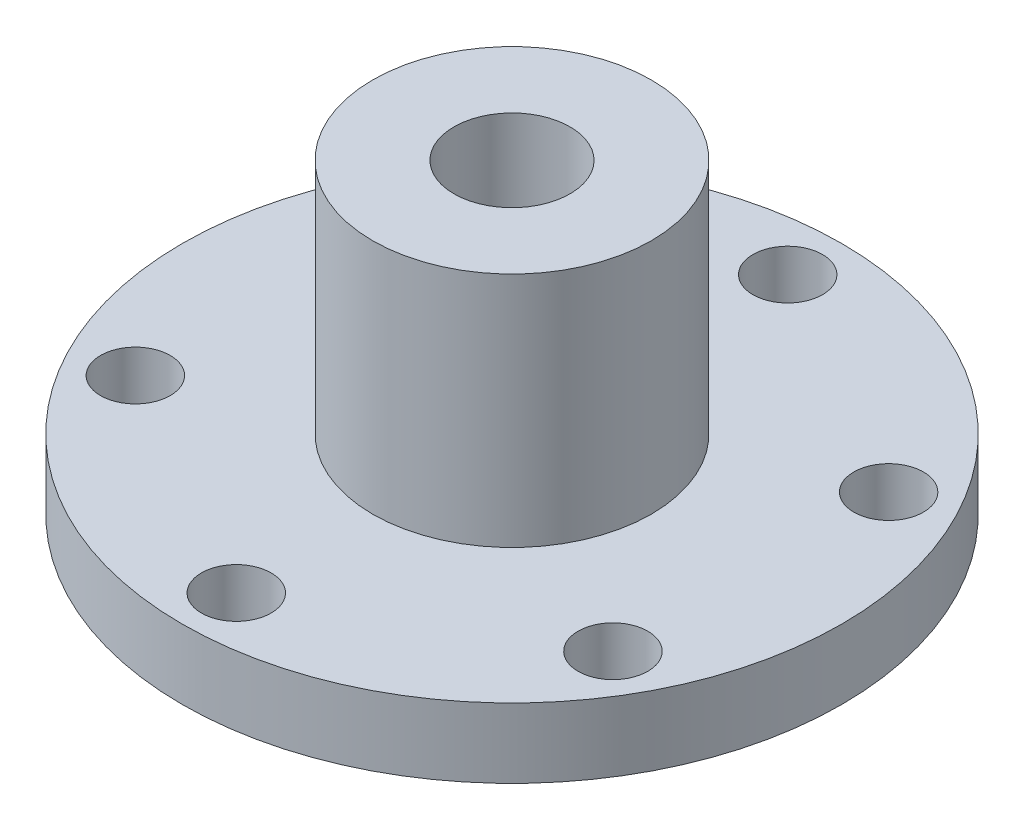
ISO-10303-21;
HEADER;
FILE_DESCRIPTION(('STEP AP214'),'2;1');
FILE_NAME('part.step','',(''),(''),'','','');
FILE_SCHEMA(('AUTOMOTIVE_DESIGN { 1 0 10303 214 1 1 1 1 }'));
ENDSEC;
DATA;
#1=APPLICATION_CONTEXT('core data for automotive mechanical design processes');
#2=APPLICATION_PROTOCOL_DEFINITION('international standard','automotive_design',2000,#1);
#3=PRODUCT_CONTEXT('',#1,'mechanical');
#4=PRODUCT('Part','Part','',(#3));
#5=PRODUCT_RELATED_PRODUCT_CATEGORY('part','',(#4));
#6=PRODUCT_DEFINITION_FORMATION('','',#4);
#7=PRODUCT_DEFINITION_CONTEXT('part definition',#1,'design');
#8=PRODUCT_DEFINITION('design','',#6,#7);
#9=PRODUCT_DEFINITION_SHAPE('','',#8);
#10=(LENGTH_UNIT() NAMED_UNIT(*) SI_UNIT(.MILLI.,.METRE.));
#11=(NAMED_UNIT(*) PLANE_ANGLE_UNIT() SI_UNIT($,.RADIAN.));
#12=(NAMED_UNIT(*) SI_UNIT($,.STERADIAN.) SOLID_ANGLE_UNIT());
#13=UNCERTAINTY_MEASURE_WITH_UNIT(LENGTH_MEASURE(1.E-05),#10,'distance_accuracy_value','');
#14=(GEOMETRIC_REPRESENTATION_CONTEXT(3) GLOBAL_UNCERTAINTY_ASSIGNED_CONTEXT((#13)) GLOBAL_UNIT_ASSIGNED_CONTEXT((#10,
#11,#12)) REPRESENTATION_CONTEXT('',''));
#15=CARTESIAN_POINT('',(0.,0.,0.));
#16=DIRECTION('',(0.,0.,1.));
#17=DIRECTION('',(1.,0.,0.));
#18=AXIS2_PLACEMENT_3D('',#15,#16,#17);
#19=CARTESIAN_POINT('',(0.,6.,0.));
#20=DIRECTION('',(0.,1.,0.));
#21=DIRECTION('',(0.,0.,1.));
#22=AXIS2_PLACEMENT_3D('',#19,#20,#21);
#23=PLANE('',#22);
#24=CARTESIAN_POINT('',(-20.5681033398798,6.,-11.8749999999988));
#25=DIRECTION('',(0.,1.,0.));
#26=DIRECTION('',(0.,0.,1.));
#27=AXIS2_PLACEMENT_3D('',#24,#25,#26);
#28=CIRCLE('',#27,3.00000000000126);
#29=CARTESIAN_POINT('',(-20.5681033398798,6.,-8.87499999999756));
#30=VERTEX_POINT('',#29);
#31=EDGE_CURVE('E78',#30,#30,#28,.T.);
#32=ORIENTED_EDGE('',*,*,#31,.F.);
#33=EDGE_LOOP('',(#32));
#34=FACE_BOUND('',#33,.T.);
#35=CARTESIAN_POINT('',(2.69133678744446E-12,6.,23.75));
#36=DIRECTION('',(0.,1.,0.));
#37=DIRECTION('',(0.,0.,1.));
#38=AXIS2_PLACEMENT_3D('',#35,#36,#37);
#39=CIRCLE('',#38,3.00000000000273);
#40=CARTESIAN_POINT('',(2.69133678744446E-12,6.,26.7500000000027));
#41=VERTEX_POINT('',#40);
#42=EDGE_CURVE('E66',#41,#41,#39,.T.);
#43=ORIENTED_EDGE('',*,*,#42,.F.);
#44=EDGE_LOOP('',(#43));
#45=FACE_BOUND('',#44,.T.);
#46=CARTESIAN_POINT('',(20.5681033398811,6.,-11.8750000000012));
#47=DIRECTION('',(0.,1.,0.));
#48=DIRECTION('',(0.,0.,1.));
#49=AXIS2_PLACEMENT_3D('',#46,#47,#48);
#50=CIRCLE('',#49,3.00000000000036);
#51=CARTESIAN_POINT('',(20.5681033398811,6.,-8.87500000000081));
#52=VERTEX_POINT('',#51);
#53=EDGE_CURVE('E54',#52,#52,#50,.T.);
#54=ORIENTED_EDGE('',*,*,#53,.F.);
#55=EDGE_LOOP('',(#54));
#56=FACE_BOUND('',#55,.T.);
#57=CARTESIAN_POINT('',(0.,6.,0.));
#58=DIRECTION('',(0.,1.,0.));
#59=DIRECTION('',(0.,0.,1.));
#60=AXIS2_PLACEMENT_3D('',#57,#58,#59);
#61=CIRCLE('',#60,28.4);
#62=CARTESIAN_POINT('',(0.,6.,28.4));
#63=VERTEX_POINT('',#62);
#64=EDGE_CURVE('E10',#63,#63,#61,.T.);
#65=ORIENTED_EDGE('',*,*,#64,.T.);
#66=EDGE_LOOP('',(#65));
#67=FACE_BOUND('',#66,.T.);
#68=CARTESIAN_POINT('',(0.,6.,-23.75));
#69=DIRECTION('',(0.,1.,0.));
#70=DIRECTION('',(0.,0.,1.));
#71=AXIS2_PLACEMENT_3D('',#68,#69,#70);
#72=CIRCLE('',#71,3.);
#73=CARTESIAN_POINT('',(0.,6.,-20.75));
#74=VERTEX_POINT('',#73);
#75=EDGE_CURVE('E50',#74,#74,#72,.T.);
#76=ORIENTED_EDGE('',*,*,#75,.F.);
#77=EDGE_LOOP('',(#76));
#78=FACE_BOUND('',#77,.T.);
#79=CARTESIAN_POINT('',(20.5681033398824,6.,11.8749999999988));
#80=DIRECTION('',(0.,1.,0.));
#81=DIRECTION('',(0.,0.,1.));
#82=AXIS2_PLACEMENT_3D('',#79,#80,#81);
#83=CIRCLE('',#82,3.0000000000017);
#84=CARTESIAN_POINT('',(20.5681033398824,6.,14.8750000000005));
#85=VERTEX_POINT('',#84);
#86=EDGE_CURVE('E60',#85,#85,#83,.T.);
#87=ORIENTED_EDGE('',*,*,#86,.F.);
#88=EDGE_LOOP('',(#87));
#89=FACE_BOUND('',#88,.T.);
#90=CARTESIAN_POINT('',(-20.5681033398784,6.,11.8750000000012));
#91=DIRECTION('',(0.,1.,0.));
#92=DIRECTION('',(0.,0.,1.));
#93=AXIS2_PLACEMENT_3D('',#90,#91,#92);
#94=CIRCLE('',#93,3.00000000000249);
#95=CARTESIAN_POINT('',(-20.5681033398784,6.,14.8750000000037));
#96=VERTEX_POINT('',#95);
#97=EDGE_CURVE('E72',#96,#96,#94,.T.);
#98=ORIENTED_EDGE('',*,*,#97,.F.);
#99=EDGE_LOOP('',(#98));
#100=FACE_BOUND('',#99,.T.);
#101=CARTESIAN_POINT('',(0.,6.,0.));
#102=DIRECTION('',(0.,1.,0.));
#103=DIRECTION('',(0.,0.,1.));
#104=AXIS2_PLACEMENT_3D('',#101,#102,#103);
#105=CIRCLE('',#104,12.);
#106=CARTESIAN_POINT('',(0.,6.,12.));
#107=VERTEX_POINT('',#106);
#108=EDGE_CURVE('E87',#107,#107,#105,.T.);
#109=ORIENTED_EDGE('',*,*,#108,.F.);
#110=EDGE_LOOP('',(#109));
#111=FACE_BOUND('',#110,.T.);
#112=ADVANCED_FACE('F35',(#34,#45,#56,#67,#78,#89,#100,#111),#23,.T.);
#113=CARTESIAN_POINT('',(0.,0.,0.));
#114=DIRECTION('',(0.,1.,0.));
#115=DIRECTION('',(0.,0.,1.));
#116=AXIS2_PLACEMENT_3D('',#113,#114,#115);
#117=PLANE('',#116);
#118=CARTESIAN_POINT('',(0.,0.,0.));
#119=DIRECTION('',(0.,1.,0.));
#120=DIRECTION('',(0.,0.,1.));
#121=AXIS2_PLACEMENT_3D('',#118,#119,#120);
#122=CIRCLE('',#121,28.4);
#123=CARTESIAN_POINT('',(0.,0.,28.4));
#124=VERTEX_POINT('',#123);
#125=EDGE_CURVE('E39',#124,#124,#122,.T.);
#126=ORIENTED_EDGE('',*,*,#125,.F.);
#127=EDGE_LOOP('',(#126));
#128=FACE_BOUND('',#127,.T.);
#129=CARTESIAN_POINT('',(0.,0.,0.));
#130=DIRECTION('',(0.,1.,0.));
#131=DIRECTION('',(0.,0.,1.));
#132=AXIS2_PLACEMENT_3D('',#129,#130,#131);
#133=CIRCLE('',#132,5.);
#134=CARTESIAN_POINT('',(0.,0.,5.));
#135=VERTEX_POINT('',#134);
#136=EDGE_CURVE('E46',#135,#135,#133,.T.);
#137=ORIENTED_EDGE('',*,*,#136,.T.);
#138=EDGE_LOOP('',(#137));
#139=FACE_BOUND('',#138,.T.);
#140=CARTESIAN_POINT('',(0.,0.,-23.75));
#141=DIRECTION('',(0.,1.,0.));
#142=DIRECTION('',(0.,0.,1.));
#143=AXIS2_PLACEMENT_3D('',#140,#141,#142);
#144=CIRCLE('',#143,3.);
#145=CARTESIAN_POINT('',(0.,0.,-20.75));
#146=VERTEX_POINT('',#145);
#147=EDGE_CURVE('E51',#146,#146,#144,.T.);
#148=ORIENTED_EDGE('',*,*,#147,.T.);
#149=EDGE_LOOP('',(#148));
#150=FACE_BOUND('',#149,.T.);
#151=CARTESIAN_POINT('',(20.5681033398811,0.,-11.8750000000012));
#152=DIRECTION('',(0.,1.,0.));
#153=DIRECTION('',(0.,0.,1.));
#154=AXIS2_PLACEMENT_3D('',#151,#152,#153);
#155=CIRCLE('',#154,3.00000000000036);
#156=CARTESIAN_POINT('',(20.5681033398811,0.,-8.87500000000081));
#157=VERTEX_POINT('',#156);
#158=EDGE_CURVE('E57',#157,#157,#155,.T.);
#159=ORIENTED_EDGE('',*,*,#158,.T.);
#160=EDGE_LOOP('',(#159));
#161=FACE_BOUND('',#160,.T.);
#162=CARTESIAN_POINT('',(20.5681033398824,0.,11.8749999999988));
#163=DIRECTION('',(0.,1.,0.));
#164=DIRECTION('',(0.,0.,1.));
#165=AXIS2_PLACEMENT_3D('',#162,#163,#164);
#166=CIRCLE('',#165,3.0000000000017);
#167=CARTESIAN_POINT('',(20.5681033398824,0.,14.8750000000005));
#168=VERTEX_POINT('',#167);
#169=EDGE_CURVE('E63',#168,#168,#166,.T.);
#170=ORIENTED_EDGE('',*,*,#169,.T.);
#171=EDGE_LOOP('',(#170));
#172=FACE_BOUND('',#171,.T.);
#173=CARTESIAN_POINT('',(2.69133678744446E-12,0.,23.75));
#174=DIRECTION('',(0.,1.,0.));
#175=DIRECTION('',(0.,0.,1.));
#176=AXIS2_PLACEMENT_3D('',#173,#174,#175);
#177=CIRCLE('',#176,3.00000000000273);
#178=CARTESIAN_POINT('',(2.69133678744446E-12,0.,26.7500000000027));
#179=VERTEX_POINT('',#178);
#180=EDGE_CURVE('E69',#179,#179,#177,.T.);
#181=ORIENTED_EDGE('',*,*,#180,.T.);
#182=EDGE_LOOP('',(#181));
#183=FACE_BOUND('',#182,.T.);
#184=CARTESIAN_POINT('',(-20.5681033398784,0.,11.8750000000012));
#185=DIRECTION('',(0.,1.,0.));
#186=DIRECTION('',(0.,0.,1.));
#187=AXIS2_PLACEMENT_3D('',#184,#185,#186);
#188=CIRCLE('',#187,3.00000000000249);
#189=CARTESIAN_POINT('',(-20.5681033398784,0.,14.8750000000037));
#190=VERTEX_POINT('',#189);
#191=EDGE_CURVE('E75',#190,#190,#188,.T.);
#192=ORIENTED_EDGE('',*,*,#191,.T.);
#193=EDGE_LOOP('',(#192));
#194=FACE_BOUND('',#193,.T.);
#195=CARTESIAN_POINT('',(-20.5681033398798,0.,-11.8749999999988));
#196=DIRECTION('',(0.,1.,0.));
#197=DIRECTION('',(0.,0.,1.));
#198=AXIS2_PLACEMENT_3D('',#195,#196,#197);
#199=CIRCLE('',#198,3.00000000000126);
#200=CARTESIAN_POINT('',(-20.5681033398798,0.,-8.87499999999756));
#201=VERTEX_POINT('',#200);
#202=EDGE_CURVE('E81',#201,#201,#199,.T.);
#203=ORIENTED_EDGE('',*,*,#202,.T.);
#204=EDGE_LOOP('',(#203));
#205=FACE_BOUND('',#204,.T.);
#206=ADVANCED_FACE('F114',(#128,#139,#150,#161,#172,#183,#194,#205),#117,.F.);
#207=CARTESIAN_POINT('',(0.,6.,0.));
#208=DIRECTION('',(0.,-1.,0.));
#209=DIRECTION('',(0.,0.,-1.));
#210=AXIS2_PLACEMENT_3D('',#207,#208,#209);
#211=CYLINDRICAL_SURFACE('',#210,28.4);
#212=ORIENTED_EDGE('',*,*,#64,.F.);
#213=EDGE_LOOP('',(#212));
#214=FACE_BOUND('',#213,.T.);
#215=ORIENTED_EDGE('',*,*,#125,.T.);
#216=EDGE_LOOP('',(#215));
#217=FACE_BOUND('',#216,.T.);
#218=ADVANCED_FACE('F37',(#214,#217),#211,.T.);
#219=CARTESIAN_POINT('',(0.,6.,0.));
#220=DIRECTION('',(0.,-1.,0.));
#221=DIRECTION('',(0.,0.,-1.));
#222=AXIS2_PLACEMENT_3D('',#219,#220,#221);
#223=CYLINDRICAL_SURFACE('',#222,5.);
#224=ORIENTED_EDGE('',*,*,#136,.F.);
#225=EDGE_LOOP('',(#224));
#226=FACE_BOUND('',#225,.T.);
#227=CARTESIAN_POINT('',(0.,26.4,0.));
#228=DIRECTION('',(0.,1.,0.));
#229=DIRECTION('',(0.,0.,1.));
#230=AXIS2_PLACEMENT_3D('',#227,#228,#229);
#231=CIRCLE('',#230,5.);
#232=CARTESIAN_POINT('',(0.,26.4,5.));
#233=VERTEX_POINT('',#232);
#234=EDGE_CURVE('E90',#233,#233,#231,.T.);
#235=ORIENTED_EDGE('',*,*,#234,.T.);
#236=EDGE_LOOP('',(#235));
#237=FACE_BOUND('',#236,.T.);
#238=ADVANCED_FACE('F96',(#226,#237),#223,.F.);
#239=CARTESIAN_POINT('',(0.,6.,-23.75));
#240=DIRECTION('',(0.,-1.,0.));
#241=DIRECTION('',(0.,0.,-1.));
#242=AXIS2_PLACEMENT_3D('',#239,#240,#241);
#243=CYLINDRICAL_SURFACE('',#242,3.);
#244=ORIENTED_EDGE('',*,*,#75,.T.);
#245=EDGE_LOOP('',(#244));
#246=FACE_BOUND('',#245,.T.);
#247=ORIENTED_EDGE('',*,*,#147,.F.);
#248=EDGE_LOOP('',(#247));
#249=FACE_BOUND('',#248,.T.);
#250=ADVANCED_FACE('F126',(#246,#249),#243,.F.);
#251=CARTESIAN_POINT('',(20.5681033398811,6.,-11.8750000000012));
#252=DIRECTION('',(0.,-1.,0.));
#253=DIRECTION('',(0.,0.,-1.));
#254=AXIS2_PLACEMENT_3D('',#251,#252,#253);
#255=CYLINDRICAL_SURFACE('',#254,3.00000000000036);
#256=ORIENTED_EDGE('',*,*,#53,.T.);
#257=EDGE_LOOP('',(#256));
#258=FACE_BOUND('',#257,.T.);
#259=ORIENTED_EDGE('',*,*,#158,.F.);
#260=EDGE_LOOP('',(#259));
#261=FACE_BOUND('',#260,.T.);
#262=ADVANCED_FACE('F130',(#258,#261),#255,.F.);
#263=CARTESIAN_POINT('',(20.5681033398824,6.,11.8749999999988));
#264=DIRECTION('',(0.,-1.,0.));
#265=DIRECTION('',(0.,0.,-1.));
#266=AXIS2_PLACEMENT_3D('',#263,#264,#265);
#267=CYLINDRICAL_SURFACE('',#266,3.0000000000017);
#268=ORIENTED_EDGE('',*,*,#86,.T.);
#269=EDGE_LOOP('',(#268));
#270=FACE_BOUND('',#269,.T.);
#271=ORIENTED_EDGE('',*,*,#169,.F.);
#272=EDGE_LOOP('',(#271));
#273=FACE_BOUND('',#272,.T.);
#274=ADVANCED_FACE('F134',(#270,#273),#267,.F.);
#275=CARTESIAN_POINT('',(2.69133678744446E-12,6.,23.75));
#276=DIRECTION('',(0.,-1.,0.));
#277=DIRECTION('',(0.,0.,-1.));
#278=AXIS2_PLACEMENT_3D('',#275,#276,#277);
#279=CYLINDRICAL_SURFACE('',#278,3.00000000000273);
#280=ORIENTED_EDGE('',*,*,#42,.T.);
#281=EDGE_LOOP('',(#280));
#282=FACE_BOUND('',#281,.T.);
#283=ORIENTED_EDGE('',*,*,#180,.F.);
#284=EDGE_LOOP('',(#283));
#285=FACE_BOUND('',#284,.T.);
#286=ADVANCED_FACE('F138',(#282,#285),#279,.F.);
#287=CARTESIAN_POINT('',(-20.5681033398784,6.,11.8750000000012));
#288=DIRECTION('',(0.,-1.,0.));
#289=DIRECTION('',(0.,0.,-1.));
#290=AXIS2_PLACEMENT_3D('',#287,#288,#289);
#291=CYLINDRICAL_SURFACE('',#290,3.00000000000249);
#292=ORIENTED_EDGE('',*,*,#97,.T.);
#293=EDGE_LOOP('',(#292));
#294=FACE_BOUND('',#293,.T.);
#295=ORIENTED_EDGE('',*,*,#191,.F.);
#296=EDGE_LOOP('',(#295));
#297=FACE_BOUND('',#296,.T.);
#298=ADVANCED_FACE('F110',(#294,#297),#291,.F.);
#299=CARTESIAN_POINT('',(-20.5681033398798,6.,-11.8749999999988));
#300=DIRECTION('',(0.,-1.,0.));
#301=DIRECTION('',(0.,0.,-1.));
#302=AXIS2_PLACEMENT_3D('',#299,#300,#301);
#303=CYLINDRICAL_SURFACE('',#302,3.00000000000126);
#304=ORIENTED_EDGE('',*,*,#31,.T.);
#305=EDGE_LOOP('',(#304));
#306=FACE_BOUND('',#305,.T.);
#307=ORIENTED_EDGE('',*,*,#202,.F.);
#308=EDGE_LOOP('',(#307));
#309=FACE_BOUND('',#308,.T.);
#310=ADVANCED_FACE('F101',(#306,#309),#303,.F.);
#311=CARTESIAN_POINT('',(0.,26.4,0.));
#312=DIRECTION('',(0.,1.,0.));
#313=DIRECTION('',(0.,0.,1.));
#314=AXIS2_PLACEMENT_3D('',#311,#312,#313);
#315=PLANE('',#314);
#316=CARTESIAN_POINT('',(0.,26.4,0.));
#317=DIRECTION('',(0.,1.,0.));
#318=DIRECTION('',(0.,0.,1.));
#319=AXIS2_PLACEMENT_3D('',#316,#317,#318);
#320=CIRCLE('',#319,12.);
#321=CARTESIAN_POINT('',(0.,26.4,12.));
#322=VERTEX_POINT('',#321);
#323=EDGE_CURVE('E84',#322,#322,#320,.T.);
#324=ORIENTED_EDGE('',*,*,#323,.T.);
#325=EDGE_LOOP('',(#324));
#326=FACE_BOUND('',#325,.T.);
#327=ORIENTED_EDGE('',*,*,#234,.F.);
#328=EDGE_LOOP('',(#327));
#329=FACE_BOUND('',#328,.T.);
#330=ADVANCED_FACE('F98',(#326,#329),#315,.T.);
#331=CARTESIAN_POINT('',(0.,26.4,0.));
#332=DIRECTION('',(0.,-1.,0.));
#333=DIRECTION('',(0.,0.,-1.));
#334=AXIS2_PLACEMENT_3D('',#331,#332,#333);
#335=CYLINDRICAL_SURFACE('',#334,12.);
#336=ORIENTED_EDGE('',*,*,#323,.F.);
#337=EDGE_LOOP('',(#336));
#338=FACE_BOUND('',#337,.T.);
#339=ORIENTED_EDGE('',*,*,#108,.T.);
#340=EDGE_LOOP('',(#339));
#341=FACE_BOUND('',#340,.T.);
#342=ADVANCED_FACE('F100',(#338,#341),#335,.T.);
#343=CLOSED_SHELL('',(#112,#206,#218,#238,#250,#262,#274,#286,#298,#310,#330,#342));
#344=MANIFOLD_SOLID_BREP('B2',#343);
#345=ADVANCED_BREP_SHAPE_REPRESENTATION('',(#18,#344),#14);
#346=SHAPE_DEFINITION_REPRESENTATION(#9,#345);
ENDSEC;
END-ISO-10303-21;
